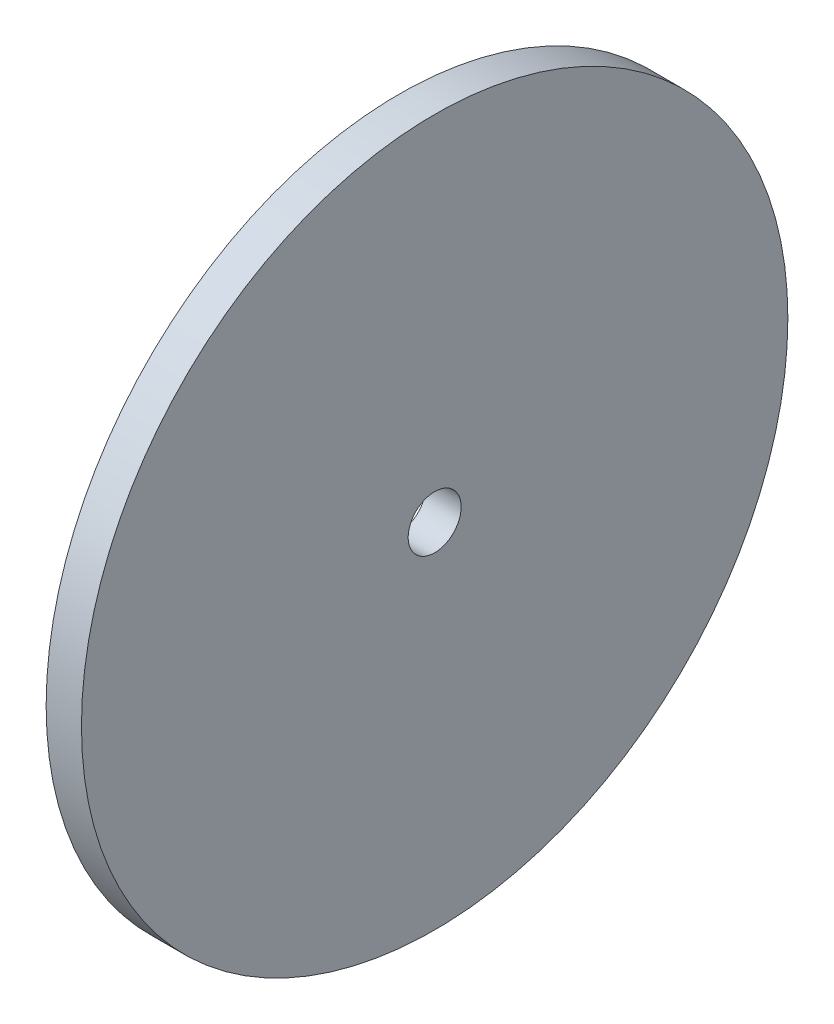
ISO-10303-21;
HEADER;
FILE_DESCRIPTION(('STEP AP214'),'2;1');
FILE_NAME('part.step','',(''),(''),'','','');
FILE_SCHEMA(('AUTOMOTIVE_DESIGN { 1 0 10303 214 1 1 1 1 }'));
ENDSEC;
DATA;
#1=APPLICATION_CONTEXT('core data for automotive mechanical design processes');
#2=APPLICATION_PROTOCOL_DEFINITION('international standard','automotive_design',2000,#1);
#3=PRODUCT_CONTEXT('',#1,'mechanical');
#4=PRODUCT('Part','Part','',(#3));
#5=PRODUCT_RELATED_PRODUCT_CATEGORY('part','',(#4));
#6=PRODUCT_DEFINITION_FORMATION('','',#4);
#7=PRODUCT_DEFINITION_CONTEXT('part definition',#1,'design');
#8=PRODUCT_DEFINITION('design','',#6,#7);
#9=PRODUCT_DEFINITION_SHAPE('','',#8);
#10=(LENGTH_UNIT() NAMED_UNIT(*) SI_UNIT(.MILLI.,.METRE.));
#11=(NAMED_UNIT(*) PLANE_ANGLE_UNIT() SI_UNIT($,.RADIAN.));
#12=(NAMED_UNIT(*) SI_UNIT($,.STERADIAN.) SOLID_ANGLE_UNIT());
#13=UNCERTAINTY_MEASURE_WITH_UNIT(LENGTH_MEASURE(1.E-05),#10,'distance_accuracy_value','');
#14=(GEOMETRIC_REPRESENTATION_CONTEXT(3) GLOBAL_UNCERTAINTY_ASSIGNED_CONTEXT((#13)) GLOBAL_UNIT_ASSIGNED_CONTEXT((#10,
#11,#12)) REPRESENTATION_CONTEXT('',''));
#15=CARTESIAN_POINT('',(0.,0.,0.));
#16=DIRECTION('',(0.,0.,1.));
#17=DIRECTION('',(1.,0.,0.));
#18=AXIS2_PLACEMENT_3D('',#15,#16,#17);
#19=CARTESIAN_POINT('',(2.,0.,0.));
#20=DIRECTION('',(-1.,0.,0.));
#21=DIRECTION('',(0.,0.,1.));
#22=AXIS2_PLACEMENT_3D('',#19,#20,#21);
#23=CYLINDRICAL_SURFACE('',#22,20.);
#24=CARTESIAN_POINT('',(2.,0.,0.));
#25=DIRECTION('',(1.,0.,0.));
#26=DIRECTION('',(0.,0.,-1.));
#27=AXIS2_PLACEMENT_3D('',#24,#25,#26);
#28=CIRCLE('',#27,20.);
#29=CARTESIAN_POINT('',(2.,0.,-20.));
#30=VERTEX_POINT('',#29);
#31=EDGE_CURVE('E10',#30,#30,#28,.T.);
#32=ORIENTED_EDGE('',*,*,#31,.F.);
#33=EDGE_LOOP('',(#32));
#34=FACE_BOUND('',#33,.T.);
#35=CARTESIAN_POINT('',(0.,0.,0.));
#36=DIRECTION('',(1.,0.,0.));
#37=DIRECTION('',(0.,0.,-1.));
#38=AXIS2_PLACEMENT_3D('',#35,#36,#37);
#39=CIRCLE('',#38,20.);
#40=CARTESIAN_POINT('',(0.,0.,-20.));
#41=VERTEX_POINT('',#40);
#42=EDGE_CURVE('E36',#41,#41,#39,.T.);
#43=ORIENTED_EDGE('',*,*,#42,.T.);
#44=EDGE_LOOP('',(#43));
#45=FACE_BOUND('',#44,.T.);
#46=ADVANCED_FACE('F33',(#34,#45),#23,.T.);
#47=CARTESIAN_POINT('',(2.,0.,0.));
#48=DIRECTION('',(1.,0.,0.));
#49=DIRECTION('',(0.,0.,-1.));
#50=AXIS2_PLACEMENT_3D('',#47,#48,#49);
#51=PLANE('',#50);
#52=CARTESIAN_POINT('',(2.,0.,0.));
#53=DIRECTION('',(1.,0.,0.));
#54=DIRECTION('',(0.,0.,-1.));
#55=AXIS2_PLACEMENT_3D('',#52,#53,#54);
#56=CIRCLE('',#55,1.5);
#57=CARTESIAN_POINT('',(2.,0.,-1.5));
#58=VERTEX_POINT('',#57);
#59=EDGE_CURVE('E45',#58,#58,#56,.T.);
#60=ORIENTED_EDGE('',*,*,#59,.F.);
#61=EDGE_LOOP('',(#60));
#62=FACE_BOUND('',#61,.T.);
#63=ORIENTED_EDGE('',*,*,#31,.T.);
#64=EDGE_LOOP('',(#63));
#65=FACE_BOUND('',#64,.T.);
#66=ADVANCED_FACE('F60',(#62,#65),#51,.T.);
#67=CARTESIAN_POINT('',(0.,0.,0.));
#68=DIRECTION('',(1.,0.,0.));
#69=DIRECTION('',(0.,0.,-1.));
#70=AXIS2_PLACEMENT_3D('',#67,#68,#69);
#71=PLANE('',#70);
#72=CARTESIAN_POINT('',(0.,0.,0.));
#73=DIRECTION('',(1.,0.,0.));
#74=DIRECTION('',(0.,0.,-1.));
#75=AXIS2_PLACEMENT_3D('',#72,#73,#74);
#76=CIRCLE('',#75,1.5);
#77=CARTESIAN_POINT('',(0.,0.,-1.5));
#78=VERTEX_POINT('',#77);
#79=EDGE_CURVE('E43',#78,#78,#76,.T.);
#80=ORIENTED_EDGE('',*,*,#79,.T.);
#81=EDGE_LOOP('',(#80));
#82=FACE_BOUND('',#81,.T.);
#83=ORIENTED_EDGE('',*,*,#42,.F.);
#84=EDGE_LOOP('',(#83));
#85=FACE_BOUND('',#84,.T.);
#86=ADVANCED_FACE('F51',(#82,#85),#71,.F.);
#87=CARTESIAN_POINT('',(0.,0.,0.));
#88=DIRECTION('',(1.,0.,0.));
#89=DIRECTION('',(0.,0.,-1.));
#90=AXIS2_PLACEMENT_3D('',#87,#88,#89);
#91=CYLINDRICAL_SURFACE('',#90,1.5);
#92=ORIENTED_EDGE('',*,*,#79,.F.);
#93=EDGE_LOOP('',(#92));
#94=FACE_BOUND('',#93,.T.);
#95=ORIENTED_EDGE('',*,*,#59,.T.);
#96=EDGE_LOOP('',(#95));
#97=FACE_BOUND('',#96,.T.);
#98=ADVANCED_FACE('F54',(#94,#97),#91,.F.);
#99=CLOSED_SHELL('',(#46,#66,#86,#98));
#100=MANIFOLD_SOLID_BREP('B2',#99);
#101=ADVANCED_BREP_SHAPE_REPRESENTATION('',(#18,#100),#14);
#102=SHAPE_DEFINITION_REPRESENTATION(#9,#101);
ENDSEC;
END-ISO-10303-21;
